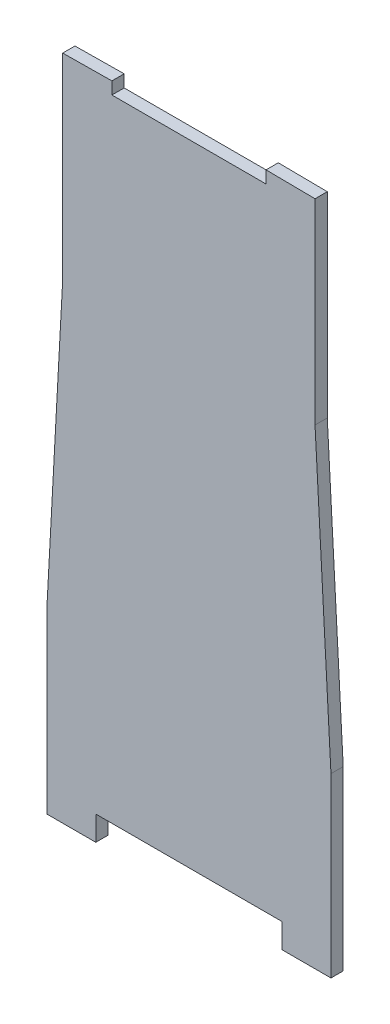
ISO-10303-21;
HEADER;
FILE_DESCRIPTION(('STEP AP214'),'2;1');
FILE_NAME('part.step','',(''),(''),'','','');
FILE_SCHEMA(('AUTOMOTIVE_DESIGN { 1 0 10303 214 1 1 1 1 }'));
ENDSEC;
DATA;
#1=APPLICATION_CONTEXT('core data for automotive mechanical design processes');
#2=APPLICATION_PROTOCOL_DEFINITION('international standard','automotive_design',2000,#1);
#3=PRODUCT_CONTEXT('',#1,'mechanical');
#4=PRODUCT('Part','Part','',(#3));
#5=PRODUCT_RELATED_PRODUCT_CATEGORY('part','',(#4));
#6=PRODUCT_DEFINITION_FORMATION('','',#4);
#7=PRODUCT_DEFINITION_CONTEXT('part definition',#1,'design');
#8=PRODUCT_DEFINITION('design','',#6,#7);
#9=PRODUCT_DEFINITION_SHAPE('','',#8);
#10=(LENGTH_UNIT() NAMED_UNIT(*) SI_UNIT(.MILLI.,.METRE.));
#11=(NAMED_UNIT(*) PLANE_ANGLE_UNIT() SI_UNIT($,.RADIAN.));
#12=(NAMED_UNIT(*) SI_UNIT($,.STERADIAN.) SOLID_ANGLE_UNIT());
#13=UNCERTAINTY_MEASURE_WITH_UNIT(LENGTH_MEASURE(1.E-05),#10,'distance_accuracy_value','');
#14=(GEOMETRIC_REPRESENTATION_CONTEXT(3) GLOBAL_UNCERTAINTY_ASSIGNED_CONTEXT((#13)) GLOBAL_UNIT_ASSIGNED_CONTEXT((#10,
#11,#12)) REPRESENTATION_CONTEXT('',''));
#15=CARTESIAN_POINT('',(0.,0.,0.));
#16=DIRECTION('',(0.,0.,1.));
#17=DIRECTION('',(1.,0.,0.));
#18=AXIS2_PLACEMENT_3D('',#15,#16,#17);
#19=CARTESIAN_POINT('',(65.405,278.862611940028,6.35));
#20=DIRECTION('',(-1.,0.,0.));
#21=DIRECTION('',(0.,0.,1.));
#22=AXIS2_PLACEMENT_3D('',#19,#20,#21);
#23=PLANE('',#22);
#24=DIRECTION('',(0.,1.,0.));
#25=VECTOR('',#24,1.);
#26=CARTESIAN_POINT('',(65.405,278.862611940028,0.));
#27=LINE('',#26,#25);
#28=CARTESIAN_POINT('',(65.405,278.862611940028,0.));
#29=VERTEX_POINT('',#28);
#30=CARTESIAN_POINT('',(65.405,380.462611940028,0.));
#31=VERTEX_POINT('',#30);
#32=EDGE_CURVE('E194',#29,#31,#27,.T.);
#33=ORIENTED_EDGE('',*,*,#32,.T.);
#34=DIRECTION('',(0.,0.,-1.));
#35=VECTOR('',#34,1.);
#36=CARTESIAN_POINT('',(65.405,380.462611940028,6.35));
#37=LINE('',#36,#35);
#38=CARTESIAN_POINT('',(65.405,380.462611940028,6.35));
#39=VERTEX_POINT('',#38);
#40=EDGE_CURVE('E11',#39,#31,#37,.T.);
#41=ORIENTED_EDGE('',*,*,#40,.F.);
#42=DIRECTION('',(0.,1.,0.));
#43=VECTOR('',#42,1.);
#44=CARTESIAN_POINT('',(65.405,278.862611940028,6.35));
#45=LINE('',#44,#43);
#46=CARTESIAN_POINT('',(65.405,278.862611940028,6.35));
#47=VERTEX_POINT('',#46);
#48=EDGE_CURVE('E241',#47,#39,#45,.T.);
#49=ORIENTED_EDGE('',*,*,#48,.F.);
#50=DIRECTION('',(0.,0.,-1.));
#51=VECTOR('',#50,1.);
#52=CARTESIAN_POINT('',(65.405,278.862611940028,6.35));
#53=LINE('',#52,#51);
#54=EDGE_CURVE('E190',#47,#29,#53,.T.);
#55=ORIENTED_EDGE('',*,*,#54,.T.);
#56=EDGE_LOOP('',(#33,#41,#49,#55));
#57=FACE_BOUND('',#56,.T.);
#58=ADVANCED_FACE('F45',(#57),#23,.F.);
#59=CARTESIAN_POINT('',(65.405,380.462611940028,6.35));
#60=DIRECTION('',(-0.010747646833242,-0.999942242375802,0.));
#61=DIRECTION('',(0.999942242375803,-0.010747646833242,0.));
#62=AXIS2_PLACEMENT_3D('',#59,#60,#61);
#63=PLANE('',#62);
#64=DIRECTION('',(-0.999942242375802,0.010747646833242,0.));
#65=VECTOR('',#64,1.);
#66=CARTESIAN_POINT('',(65.405,380.462611940028,0.));
#67=LINE('',#66,#65);
#68=CARTESIAN_POINT('',(40.0064359283482,380.735602504028,0.));
#69=VERTEX_POINT('',#68);
#70=EDGE_CURVE('E198',#31,#69,#67,.T.);
#71=ORIENTED_EDGE('',*,*,#70,.T.);
#72=DIRECTION('',(0.,0.,-1.));
#73=VECTOR('',#72,1.);
#74=CARTESIAN_POINT('',(40.0064359283482,380.735602504028,6.35));
#75=LINE('',#74,#73);
#76=CARTESIAN_POINT('',(40.0064359283482,380.735602504028,6.35));
#77=VERTEX_POINT('',#76);
#78=EDGE_CURVE('E54',#77,#69,#75,.T.);
#79=ORIENTED_EDGE('',*,*,#78,.F.);
#80=DIRECTION('',(-0.999942242375802,0.010747646833242,0.));
#81=VECTOR('',#80,1.);
#82=CARTESIAN_POINT('',(65.405,380.462611940028,6.35));
#83=LINE('',#82,#81);
#84=EDGE_CURVE('E128',#39,#77,#83,.T.);
#85=ORIENTED_EDGE('',*,*,#84,.F.);
#86=ORIENTED_EDGE('',*,*,#40,.T.);
#87=EDGE_LOOP('',(#71,#79,#85,#86));
#88=FACE_BOUND('',#87,.T.);
#89=ADVANCED_FACE('F363',(#88),#63,.F.);
#90=CARTESIAN_POINT('',(40.0064359283482,380.735602504028,6.35));
#91=DIRECTION('',(1.,0.,0.));
#92=DIRECTION('',(0.,0.,-1.));
#93=AXIS2_PLACEMENT_3D('',#90,#91,#92);
#94=PLANE('',#93);
#95=DIRECTION('',(0.,-1.,0.));
#96=VECTOR('',#95,1.);
#97=CARTESIAN_POINT('',(40.0064359283482,380.735602504028,0.));
#98=LINE('',#97,#96);
#99=CARTESIAN_POINT('',(40.0064359283482,374.384170325028,0.));
#100=VERTEX_POINT('',#99);
#101=EDGE_CURVE('E201',#69,#100,#98,.T.);
#102=ORIENTED_EDGE('',*,*,#101,.T.);
#103=DIRECTION('',(0.,0.,-1.));
#104=VECTOR('',#103,1.);
#105=CARTESIAN_POINT('',(40.0064359283482,374.384170325028,6.35));
#106=LINE('',#105,#104);
#107=CARTESIAN_POINT('',(40.0064359283482,374.384170325028,6.35));
#108=VERTEX_POINT('',#107);
#109=EDGE_CURVE('E284',#108,#100,#106,.T.);
#110=ORIENTED_EDGE('',*,*,#109,.F.);
#111=DIRECTION('',(0.,-1.,0.));
#112=VECTOR('',#111,1.);
#113=CARTESIAN_POINT('',(40.0064359283482,380.735602504028,6.35));
#114=LINE('',#113,#112);
#115=EDGE_CURVE('E294',#77,#108,#114,.T.);
#116=ORIENTED_EDGE('',*,*,#115,.F.);
#117=ORIENTED_EDGE('',*,*,#78,.T.);
#118=EDGE_LOOP('',(#102,#110,#116,#117));
#119=FACE_BOUND('',#118,.T.);
#120=ADVANCED_FACE('F292',(#119),#94,.F.);
#121=CARTESIAN_POINT('',(-39.8999353030196,374.384170325028,6.35));
#122=DIRECTION('',(0.,-1.,0.));
#123=DIRECTION('',(0.,0.,-1.));
#124=AXIS2_PLACEMENT_3D('',#121,#122,#123);
#125=PLANE('',#124);
#126=DIRECTION('',(-1.,0.,0.));
#127=VECTOR('',#126,1.);
#128=CARTESIAN_POINT('',(-39.8999353030196,374.384170325028,0.));
#129=LINE('',#128,#127);
#130=CARTESIAN_POINT('',(-39.8999353030196,374.384170325028,0.));
#131=VERTEX_POINT('',#130);
#132=EDGE_CURVE('E204',#100,#131,#129,.T.);
#133=ORIENTED_EDGE('',*,*,#132,.T.);
#134=DIRECTION('',(0.,0.,-1.));
#135=VECTOR('',#134,1.);
#136=CARTESIAN_POINT('',(-39.8999353030196,374.384170325028,6.35));
#137=LINE('',#136,#135);
#138=CARTESIAN_POINT('',(-39.8999353030196,374.384170325028,6.35));
#139=VERTEX_POINT('',#138);
#140=EDGE_CURVE('E280',#139,#131,#137,.T.);
#141=ORIENTED_EDGE('',*,*,#140,.F.);
#142=DIRECTION('',(-1.,0.,0.));
#143=VECTOR('',#142,1.);
#144=CARTESIAN_POINT('',(-39.8999353030196,374.384170325028,6.35));
#145=LINE('',#144,#143);
#146=EDGE_CURVE('E313',#108,#139,#145,.T.);
#147=ORIENTED_EDGE('',*,*,#146,.F.);
#148=ORIENTED_EDGE('',*,*,#109,.T.);
#149=EDGE_LOOP('',(#133,#141,#147,#148));
#150=FACE_BOUND('',#149,.T.);
#151=ADVANCED_FACE('F303',(#150),#125,.F.);
#152=CARTESIAN_POINT('',(-39.8999353030196,380.734170325028,6.35));
#153=DIRECTION('',(-1.,0.,0.));
#154=DIRECTION('',(0.,0.,1.));
#155=AXIS2_PLACEMENT_3D('',#152,#153,#154);
#156=PLANE('',#155);
#157=DIRECTION('',(0.,1.,0.));
#158=VECTOR('',#157,1.);
#159=CARTESIAN_POINT('',(-39.8999353030196,380.734170325028,0.));
#160=LINE('',#159,#158);
#161=CARTESIAN_POINT('',(-39.8999353030196,380.734170325028,0.));
#162=VERTEX_POINT('',#161);
#163=EDGE_CURVE('E207',#131,#162,#160,.T.);
#164=ORIENTED_EDGE('',*,*,#163,.T.);
#165=DIRECTION('',(0.,0.,-1.));
#166=VECTOR('',#165,1.);
#167=CARTESIAN_POINT('',(-39.8999353030196,380.734170325028,6.35));
#168=LINE('',#167,#166);
#169=CARTESIAN_POINT('',(-39.8999353030196,380.734170325028,6.35));
#170=VERTEX_POINT('',#169);
#171=EDGE_CURVE('E276',#170,#162,#168,.T.);
#172=ORIENTED_EDGE('',*,*,#171,.F.);
#173=DIRECTION('',(0.,1.,0.));
#174=VECTOR('',#173,1.);
#175=CARTESIAN_POINT('',(-39.8999353030196,380.734170325028,6.35));
#176=LINE('',#175,#174);
#177=EDGE_CURVE('E309',#139,#170,#176,.T.);
#178=ORIENTED_EDGE('',*,*,#177,.F.);
#179=ORIENTED_EDGE('',*,*,#140,.T.);
#180=EDGE_LOOP('',(#164,#172,#178,#179));
#181=FACE_BOUND('',#180,.T.);
#182=ADVANCED_FACE('F307',(#181),#156,.F.);
#183=CARTESIAN_POINT('',(-65.405,380.462611940028,6.35));
#184=DIRECTION('',(0.0106466302720103,-0.999943323025786,0.));
#185=DIRECTION('',(0.999943323025786,0.0106466302720103,0.));
#186=AXIS2_PLACEMENT_3D('',#183,#184,#185);
#187=PLANE('',#186);
#188=DIRECTION('',(-0.999943323025786,-0.0106466302720103,0.));
#189=VECTOR('',#188,1.);
#190=CARTESIAN_POINT('',(-65.405,380.462611940028,0.));
#191=LINE('',#190,#189);
#192=CARTESIAN_POINT('',(-65.405,380.462611940028,0.));
#193=VERTEX_POINT('',#192);
#194=EDGE_CURVE('E210',#162,#193,#191,.T.);
#195=ORIENTED_EDGE('',*,*,#194,.T.);
#196=DIRECTION('',(0.,0.,-1.));
#197=VECTOR('',#196,1.);
#198=CARTESIAN_POINT('',(-65.405,380.462611940028,6.35));
#199=LINE('',#198,#197);
#200=CARTESIAN_POINT('',(-65.405,380.462611940028,6.35));
#201=VERTEX_POINT('',#200);
#202=EDGE_CURVE('E272',#201,#193,#199,.T.);
#203=ORIENTED_EDGE('',*,*,#202,.F.);
#204=DIRECTION('',(-0.999943323025786,-0.0106466302720103,0.));
#205=VECTOR('',#204,1.);
#206=CARTESIAN_POINT('',(-65.405,380.462611940028,6.35));
#207=LINE('',#206,#205);
#208=EDGE_CURVE('E312',#170,#201,#207,.T.);
#209=ORIENTED_EDGE('',*,*,#208,.F.);
#210=ORIENTED_EDGE('',*,*,#171,.T.);
#211=EDGE_LOOP('',(#195,#203,#209,#210));
#212=FACE_BOUND('',#211,.T.);
#213=ADVANCED_FACE('F376',(#212),#187,.F.);
#214=CARTESIAN_POINT('',(-65.405,278.862611940028,6.35));
#215=DIRECTION('',(1.,0.,0.));
#216=DIRECTION('',(0.,0.,-1.));
#217=AXIS2_PLACEMENT_3D('',#214,#215,#216);
#218=PLANE('',#217);
#219=DIRECTION('',(0.,-1.,0.));
#220=VECTOR('',#219,1.);
#221=CARTESIAN_POINT('',(-65.405,278.862611940028,0.));
#222=LINE('',#221,#220);
#223=CARTESIAN_POINT('',(-65.405,278.862611940028,0.));
#224=VERTEX_POINT('',#223);
#225=EDGE_CURVE('E213',#193,#224,#222,.T.);
#226=ORIENTED_EDGE('',*,*,#225,.T.);
#227=DIRECTION('',(0.,0.,-1.));
#228=VECTOR('',#227,1.);
#229=CARTESIAN_POINT('',(-65.405,278.862611940028,6.35));
#230=LINE('',#229,#228);
#231=CARTESIAN_POINT('',(-65.405,278.862611940028,6.35));
#232=VERTEX_POINT('',#231);
#233=EDGE_CURVE('E268',#232,#224,#230,.T.);
#234=ORIENTED_EDGE('',*,*,#233,.F.);
#235=DIRECTION('',(0.,-1.,0.));
#236=VECTOR('',#235,1.);
#237=CARTESIAN_POINT('',(-65.405,278.862611940028,6.35));
#238=LINE('',#237,#236);
#239=EDGE_CURVE('E317',#201,#232,#238,.T.);
#240=ORIENTED_EDGE('',*,*,#239,.F.);
#241=ORIENTED_EDGE('',*,*,#202,.T.);
#242=EDGE_LOOP('',(#226,#234,#240,#241));
#243=FACE_BOUND('',#242,.T.);
#244=ADVANCED_FACE('F379',(#243),#218,.F.);
#245=CARTESIAN_POINT('',(-73.66,126.462611940028,6.35));
#246=DIRECTION('',(0.998536206432936,-0.0540873778484506,0.));
#247=DIRECTION('',(0.0540873778484506,0.998536206432936,0.));
#248=AXIS2_PLACEMENT_3D('',#245,#246,#247);
#249=PLANE('',#248);
#250=DIRECTION('',(-0.0540873778484506,-0.998536206432936,0.));
#251=VECTOR('',#250,1.);
#252=CARTESIAN_POINT('',(-73.66,126.462611940028,0.));
#253=LINE('',#252,#251);
#254=CARTESIAN_POINT('',(-73.66,126.462611940028,0.));
#255=VERTEX_POINT('',#254);
#256=EDGE_CURVE('E216',#224,#255,#253,.T.);
#257=ORIENTED_EDGE('',*,*,#256,.T.);
#258=DIRECTION('',(0.,0.,-1.));
#259=VECTOR('',#258,1.);
#260=CARTESIAN_POINT('',(-73.66,126.462611940028,6.35));
#261=LINE('',#260,#259);
#262=CARTESIAN_POINT('',(-73.66,126.462611940028,6.35));
#263=VERTEX_POINT('',#262);
#264=EDGE_CURVE('E264',#263,#255,#261,.T.);
#265=ORIENTED_EDGE('',*,*,#264,.F.);
#266=DIRECTION('',(-0.0540873778484506,-0.998536206432936,0.));
#267=VECTOR('',#266,1.);
#268=CARTESIAN_POINT('',(-73.66,126.462611940028,6.35));
#269=LINE('',#268,#267);
#270=EDGE_CURVE('E324',#232,#263,#269,.T.);
#271=ORIENTED_EDGE('',*,*,#270,.F.);
#272=ORIENTED_EDGE('',*,*,#233,.T.);
#273=EDGE_LOOP('',(#257,#265,#271,#272));
#274=FACE_BOUND('',#273,.T.);
#275=ADVANCED_FACE('F383',(#274),#249,.F.);
#276=CARTESIAN_POINT('',(-73.66,50.2626119400276,6.35));
#277=DIRECTION('',(1.,0.,0.));
#278=DIRECTION('',(0.,0.,-1.));
#279=AXIS2_PLACEMENT_3D('',#276,#277,#278);
#280=PLANE('',#279);
#281=DIRECTION('',(0.,-1.,0.));
#282=VECTOR('',#281,1.);
#283=CARTESIAN_POINT('',(-73.66,50.2626119400276,0.));
#284=LINE('',#283,#282);
#285=CARTESIAN_POINT('',(-73.66,34.6767981627476,0.));
#286=VERTEX_POINT('',#285);
#287=EDGE_CURVE('E220',#255,#286,#284,.T.);
#288=ORIENTED_EDGE('',*,*,#287,.T.);
#289=DIRECTION('',(0.,0.,-1.));
#290=VECTOR('',#289,1.);
#291=CARTESIAN_POINT('',(-73.66,34.6767981627476,6.35));
#292=LINE('',#291,#290);
#293=CARTESIAN_POINT('',(-73.66,34.6767981627476,6.35));
#294=VERTEX_POINT('',#293);
#295=EDGE_CURVE('E260',#294,#286,#292,.T.);
#296=ORIENTED_EDGE('',*,*,#295,.F.);
#297=DIRECTION('',(0.,-1.,0.));
#298=VECTOR('',#297,1.);
#299=CARTESIAN_POINT('',(-73.66,50.2626119400276,6.35));
#300=LINE('',#299,#298);
#301=EDGE_CURVE('E327',#263,#294,#300,.T.);
#302=ORIENTED_EDGE('',*,*,#301,.F.);
#303=ORIENTED_EDGE('',*,*,#264,.T.);
#304=EDGE_LOOP('',(#288,#296,#302,#303));
#305=FACE_BOUND('',#304,.T.);
#306=ADVANCED_FACE('F387',(#305),#280,.F.);
#307=CARTESIAN_POINT('',(-73.66,34.6767981627476,6.35));
#308=DIRECTION('',(0.,1.,0.));
#309=DIRECTION('',(0.,0.,1.));
#310=AXIS2_PLACEMENT_3D('',#307,#308,#309);
#311=PLANE('',#310);
#312=DIRECTION('',(1.,0.,0.));
#313=VECTOR('',#312,1.);
#314=CARTESIAN_POINT('',(-73.66,34.6767981627476,0.));
#315=LINE('',#314,#313);
#316=CARTESIAN_POINT('',(-48.254550210369,34.6767981627476,0.));
#317=VERTEX_POINT('',#316);
#318=EDGE_CURVE('E223',#286,#317,#315,.T.);
#319=ORIENTED_EDGE('',*,*,#318,.T.);
#320=DIRECTION('',(0.,0.,-1.));
#321=VECTOR('',#320,1.);
#322=CARTESIAN_POINT('',(-48.254550210369,34.6767981627476,6.35));
#323=LINE('',#322,#321);
#324=CARTESIAN_POINT('',(-48.254550210369,34.6767981627476,6.35));
#325=VERTEX_POINT('',#324);
#326=EDGE_CURVE('E256',#325,#317,#323,.T.);
#327=ORIENTED_EDGE('',*,*,#326,.F.);
#328=DIRECTION('',(1.,0.,0.));
#329=VECTOR('',#328,1.);
#330=CARTESIAN_POINT('',(-73.66,34.6767981627476,6.35));
#331=LINE('',#330,#329);
#332=EDGE_CURVE('E330',#294,#325,#331,.T.);
#333=ORIENTED_EDGE('',*,*,#332,.F.);
#334=ORIENTED_EDGE('',*,*,#295,.T.);
#335=EDGE_LOOP('',(#319,#327,#333,#334));
#336=FACE_BOUND('',#335,.T.);
#337=ADVANCED_FACE('F391',(#336),#311,.F.);
#338=CARTESIAN_POINT('',(-48.254550210369,34.6767981627476,6.35));
#339=DIRECTION('',(-1.,0.,0.));
#340=DIRECTION('',(0.,0.,1.));
#341=AXIS2_PLACEMENT_3D('',#338,#339,#340);
#342=PLANE('',#341);
#343=DIRECTION('',(0.,1.,0.));
#344=VECTOR('',#343,1.);
#345=CARTESIAN_POINT('',(-48.254550210369,34.6767981627476,0.));
#346=LINE('',#345,#344);
#347=CARTESIAN_POINT('',(-48.254550210369,47.3767981627476,0.));
#348=VERTEX_POINT('',#347);
#349=EDGE_CURVE('E226',#317,#348,#346,.T.);
#350=ORIENTED_EDGE('',*,*,#349,.T.);
#351=DIRECTION('',(0.,0.,-1.));
#352=VECTOR('',#351,1.);
#353=CARTESIAN_POINT('',(-48.254550210369,47.3767981627476,6.35));
#354=LINE('',#353,#352);
#355=CARTESIAN_POINT('',(-48.254550210369,47.3767981627476,6.35));
#356=VERTEX_POINT('',#355);
#357=EDGE_CURVE('E252',#356,#348,#354,.T.);
#358=ORIENTED_EDGE('',*,*,#357,.F.);
#359=DIRECTION('',(0.,1.,0.));
#360=VECTOR('',#359,1.);
#361=CARTESIAN_POINT('',(-48.254550210369,34.6767981627476,6.35));
#362=LINE('',#361,#360);
#363=EDGE_CURVE('E333',#325,#356,#362,.T.);
#364=ORIENTED_EDGE('',*,*,#363,.F.);
#365=ORIENTED_EDGE('',*,*,#326,.T.);
#366=EDGE_LOOP('',(#350,#358,#364,#365));
#367=FACE_BOUND('',#366,.T.);
#368=ADVANCED_FACE('F395',(#367),#342,.F.);
#369=CARTESIAN_POINT('',(48.254550210369,47.3767981627476,6.35));
#370=DIRECTION('',(0.,1.,0.));
#371=DIRECTION('',(-1.,0.,0.));
#372=AXIS2_PLACEMENT_3D('',#369,#370,#371);
#373=PLANE('',#372);
#374=DIRECTION('',(1.,0.,0.));
#375=VECTOR('',#374,1.);
#376=CARTESIAN_POINT('',(48.254550210369,47.3767981627476,0.));
#377=LINE('',#376,#375);
#378=CARTESIAN_POINT('',(48.254550210369,47.3767981627476,0.));
#379=VERTEX_POINT('',#378);
#380=EDGE_CURVE('E229',#348,#379,#377,.T.);
#381=ORIENTED_EDGE('',*,*,#380,.T.);
#382=DIRECTION('',(0.,0.,-1.));
#383=VECTOR('',#382,1.);
#384=CARTESIAN_POINT('',(48.254550210369,47.3767981627476,6.35));
#385=LINE('',#384,#383);
#386=CARTESIAN_POINT('',(48.254550210369,47.3767981627476,6.35));
#387=VERTEX_POINT('',#386);
#388=EDGE_CURVE('E248',#387,#379,#385,.T.);
#389=ORIENTED_EDGE('',*,*,#388,.F.);
#390=DIRECTION('',(1.,0.,0.));
#391=VECTOR('',#390,1.);
#392=CARTESIAN_POINT('',(48.254550210369,47.3767981627476,6.35));
#393=LINE('',#392,#391);
#394=EDGE_CURVE('E336',#356,#387,#393,.T.);
#395=ORIENTED_EDGE('',*,*,#394,.F.);
#396=ORIENTED_EDGE('',*,*,#357,.T.);
#397=EDGE_LOOP('',(#381,#389,#395,#396));
#398=FACE_BOUND('',#397,.T.);
#399=ADVANCED_FACE('F344',(#398),#373,.F.);
#400=CARTESIAN_POINT('',(48.254550210369,34.7119442212887,6.35));
#401=DIRECTION('',(1.,0.,0.));
#402=DIRECTION('',(0.,0.,-1.));
#403=AXIS2_PLACEMENT_3D('',#400,#401,#402);
#404=PLANE('',#403);
#405=DIRECTION('',(0.,-1.,0.));
#406=VECTOR('',#405,1.);
#407=CARTESIAN_POINT('',(48.254550210369,34.7119442212887,0.));
#408=LINE('',#407,#406);
#409=CARTESIAN_POINT('',(48.254550210369,34.7119442212887,0.));
#410=VERTEX_POINT('',#409);
#411=EDGE_CURVE('E232',#379,#410,#408,.T.);
#412=ORIENTED_EDGE('',*,*,#411,.T.);
#413=DIRECTION('',(0.,0.,-1.));
#414=VECTOR('',#413,1.);
#415=CARTESIAN_POINT('',(48.254550210369,34.7119442212887,6.35));
#416=LINE('',#415,#414);
#417=CARTESIAN_POINT('',(48.254550210369,34.7119442212887,6.35));
#418=VERTEX_POINT('',#417);
#419=EDGE_CURVE('E183',#418,#410,#416,.T.);
#420=ORIENTED_EDGE('',*,*,#419,.F.);
#421=DIRECTION('',(0.,-1.,0.));
#422=VECTOR('',#421,1.);
#423=CARTESIAN_POINT('',(48.254550210369,34.7119442212887,6.35));
#424=LINE('',#423,#422);
#425=EDGE_CURVE('E171',#387,#418,#424,.T.);
#426=ORIENTED_EDGE('',*,*,#425,.F.);
#427=ORIENTED_EDGE('',*,*,#388,.T.);
#428=EDGE_LOOP('',(#412,#420,#426,#427));
#429=FACE_BOUND('',#428,.T.);
#430=ADVANCED_FACE('F348',(#429),#404,.F.);
#431=CARTESIAN_POINT('',(73.66,34.7119442212887,6.35));
#432=DIRECTION('',(0.,1.,0.));
#433=DIRECTION('',(0.,0.,1.));
#434=AXIS2_PLACEMENT_3D('',#431,#432,#433);
#435=PLANE('',#434);
#436=DIRECTION('',(1.,0.,0.));
#437=VECTOR('',#436,1.);
#438=CARTESIAN_POINT('',(73.66,34.7119442212887,0.));
#439=LINE('',#438,#437);
#440=CARTESIAN_POINT('',(73.66,34.7119442212887,0.));
#441=VERTEX_POINT('',#440);
#442=EDGE_CURVE('E181',#410,#441,#439,.T.);
#443=ORIENTED_EDGE('',*,*,#442,.T.);
#444=DIRECTION('',(0.,0.,-1.));
#445=VECTOR('',#444,1.);
#446=CARTESIAN_POINT('',(73.66,34.7119442212887,6.35));
#447=LINE('',#446,#445);
#448=CARTESIAN_POINT('',(73.66,34.7119442212887,6.35));
#449=VERTEX_POINT('',#448);
#450=EDGE_CURVE('E178',#449,#441,#447,.T.);
#451=ORIENTED_EDGE('',*,*,#450,.F.);
#452=DIRECTION('',(1.,0.,0.));
#453=VECTOR('',#452,1.);
#454=CARTESIAN_POINT('',(73.66,34.7119442212887,6.35));
#455=LINE('',#454,#453);
#456=EDGE_CURVE('E165',#418,#449,#455,.T.);
#457=ORIENTED_EDGE('',*,*,#456,.F.);
#458=ORIENTED_EDGE('',*,*,#419,.T.);
#459=EDGE_LOOP('',(#443,#451,#457,#458));
#460=FACE_BOUND('',#459,.T.);
#461=ADVANCED_FACE('F179',(#460),#435,.F.);
#462=CARTESIAN_POINT('',(73.66,50.2626119400276,6.35));
#463=DIRECTION('',(-1.,0.,0.));
#464=DIRECTION('',(0.,0.,1.));
#465=AXIS2_PLACEMENT_3D('',#462,#463,#464);
#466=PLANE('',#465);
#467=DIRECTION('',(0.,1.,0.));
#468=VECTOR('',#467,1.);
#469=CARTESIAN_POINT('',(73.66,50.2626119400276,0.));
#470=LINE('',#469,#468);
#471=CARTESIAN_POINT('',(73.66,126.462611940028,0.));
#472=VERTEX_POINT('',#471);
#473=EDGE_CURVE('E114',#441,#472,#470,.T.);
#474=ORIENTED_EDGE('',*,*,#473,.T.);
#475=DIRECTION('',(0.,0.,-1.));
#476=VECTOR('',#475,1.);
#477=CARTESIAN_POINT('',(73.66,126.462611940028,6.35));
#478=LINE('',#477,#476);
#479=CARTESIAN_POINT('',(73.66,126.462611940028,6.35));
#480=VERTEX_POINT('',#479);
#481=EDGE_CURVE('E184',#480,#472,#478,.T.);
#482=ORIENTED_EDGE('',*,*,#481,.F.);
#483=DIRECTION('',(0.,1.,0.));
#484=VECTOR('',#483,1.);
#485=CARTESIAN_POINT('',(73.66,50.2626119400276,6.35));
#486=LINE('',#485,#484);
#487=EDGE_CURVE('E169',#449,#480,#486,.T.);
#488=ORIENTED_EDGE('',*,*,#487,.F.);
#489=ORIENTED_EDGE('',*,*,#450,.T.);
#490=EDGE_LOOP('',(#474,#482,#488,#489));
#491=FACE_BOUND('',#490,.T.);
#492=ADVANCED_FACE('F186',(#491),#466,.F.);
#493=CARTESIAN_POINT('',(73.66,126.462611940028,6.35));
#494=DIRECTION('',(-0.998536206432936,-0.0540873778484506,0.));
#495=DIRECTION('',(0.0540873778484506,-0.998536206432936,0.));
#496=AXIS2_PLACEMENT_3D('',#493,#494,#495);
#497=PLANE('',#496);
#498=DIRECTION('',(-0.0540873778484506,0.998536206432936,0.));
#499=VECTOR('',#498,1.);
#500=CARTESIAN_POINT('',(73.66,126.462611940028,0.));
#501=LINE('',#500,#499);
#502=EDGE_CURVE('E120',#472,#29,#501,.T.);
#503=ORIENTED_EDGE('',*,*,#502,.T.);
#504=ORIENTED_EDGE('',*,*,#54,.F.);
#505=DIRECTION('',(-0.0540873778484506,0.998536206432936,0.));
#506=VECTOR('',#505,1.);
#507=CARTESIAN_POINT('',(73.66,126.462611940028,6.35));
#508=LINE('',#507,#506);
#509=EDGE_CURVE('E62',#480,#47,#508,.T.);
#510=ORIENTED_EDGE('',*,*,#509,.F.);
#511=ORIENTED_EDGE('',*,*,#481,.T.);
#512=EDGE_LOOP('',(#503,#504,#510,#511));
#513=FACE_BOUND('',#512,.T.);
#514=ADVANCED_FACE('F352',(#513),#497,.F.);
#515=CARTESIAN_POINT('',(0.,0.,6.35));
#516=DIRECTION('',(0.,0.,-1.));
#517=DIRECTION('',(-1.,0.,0.));
#518=AXIS2_PLACEMENT_3D('',#515,#516,#517);
#519=PLANE('',#518);
#520=ORIENTED_EDGE('',*,*,#48,.T.);
#521=ORIENTED_EDGE('',*,*,#84,.T.);
#522=ORIENTED_EDGE('',*,*,#115,.T.);
#523=ORIENTED_EDGE('',*,*,#146,.T.);
#524=ORIENTED_EDGE('',*,*,#177,.T.);
#525=ORIENTED_EDGE('',*,*,#208,.T.);
#526=ORIENTED_EDGE('',*,*,#239,.T.);
#527=ORIENTED_EDGE('',*,*,#270,.T.);
#528=ORIENTED_EDGE('',*,*,#301,.T.);
#529=ORIENTED_EDGE('',*,*,#332,.T.);
#530=ORIENTED_EDGE('',*,*,#363,.T.);
#531=ORIENTED_EDGE('',*,*,#394,.T.);
#532=ORIENTED_EDGE('',*,*,#425,.T.);
#533=ORIENTED_EDGE('',*,*,#456,.T.);
#534=ORIENTED_EDGE('',*,*,#487,.T.);
#535=ORIENTED_EDGE('',*,*,#509,.T.);
#536=EDGE_LOOP('',(#520,#521,#522,#523,#524,#525,#526,#527,#528,#529,#530,#531,#532,#533,#534,#535));
#537=FACE_BOUND('',#536,.T.);
#538=ADVANCED_FACE('F167',(#537),#519,.F.);
#539=CARTESIAN_POINT('',(0.,0.,0.));
#540=DIRECTION('',(0.,0.,-1.));
#541=DIRECTION('',(-1.,0.,0.));
#542=AXIS2_PLACEMENT_3D('',#539,#540,#541);
#543=PLANE('',#542);
#544=ORIENTED_EDGE('',*,*,#32,.F.);
#545=ORIENTED_EDGE('',*,*,#502,.F.);
#546=ORIENTED_EDGE('',*,*,#473,.F.);
#547=ORIENTED_EDGE('',*,*,#442,.F.);
#548=ORIENTED_EDGE('',*,*,#411,.F.);
#549=ORIENTED_EDGE('',*,*,#380,.F.);
#550=ORIENTED_EDGE('',*,*,#349,.F.);
#551=ORIENTED_EDGE('',*,*,#318,.F.);
#552=ORIENTED_EDGE('',*,*,#287,.F.);
#553=ORIENTED_EDGE('',*,*,#256,.F.);
#554=ORIENTED_EDGE('',*,*,#225,.F.);
#555=ORIENTED_EDGE('',*,*,#194,.F.);
#556=ORIENTED_EDGE('',*,*,#163,.F.);
#557=ORIENTED_EDGE('',*,*,#132,.F.);
#558=ORIENTED_EDGE('',*,*,#101,.F.);
#559=ORIENTED_EDGE('',*,*,#70,.F.);
#560=EDGE_LOOP('',(#544,#545,#546,#547,#548,#549,#550,#551,#552,#553,#554,#555,#556,#557,#558,#559));
#561=FACE_BOUND('',#560,.T.);
#562=ADVANCED_FACE('F298',(#561),#543,.T.);
#563=CLOSED_SHELL('',(#58,#89,#120,#151,#182,#213,#244,#275,#306,#337,#368,#399,#430,#461,#492,
#514,#538,#562));
#564=MANIFOLD_SOLID_BREP('B2',#563);
#565=ADVANCED_BREP_SHAPE_REPRESENTATION('',(#18,#564),#14);
#566=SHAPE_DEFINITION_REPRESENTATION(#9,#565);
ENDSEC;
END-ISO-10303-21;
